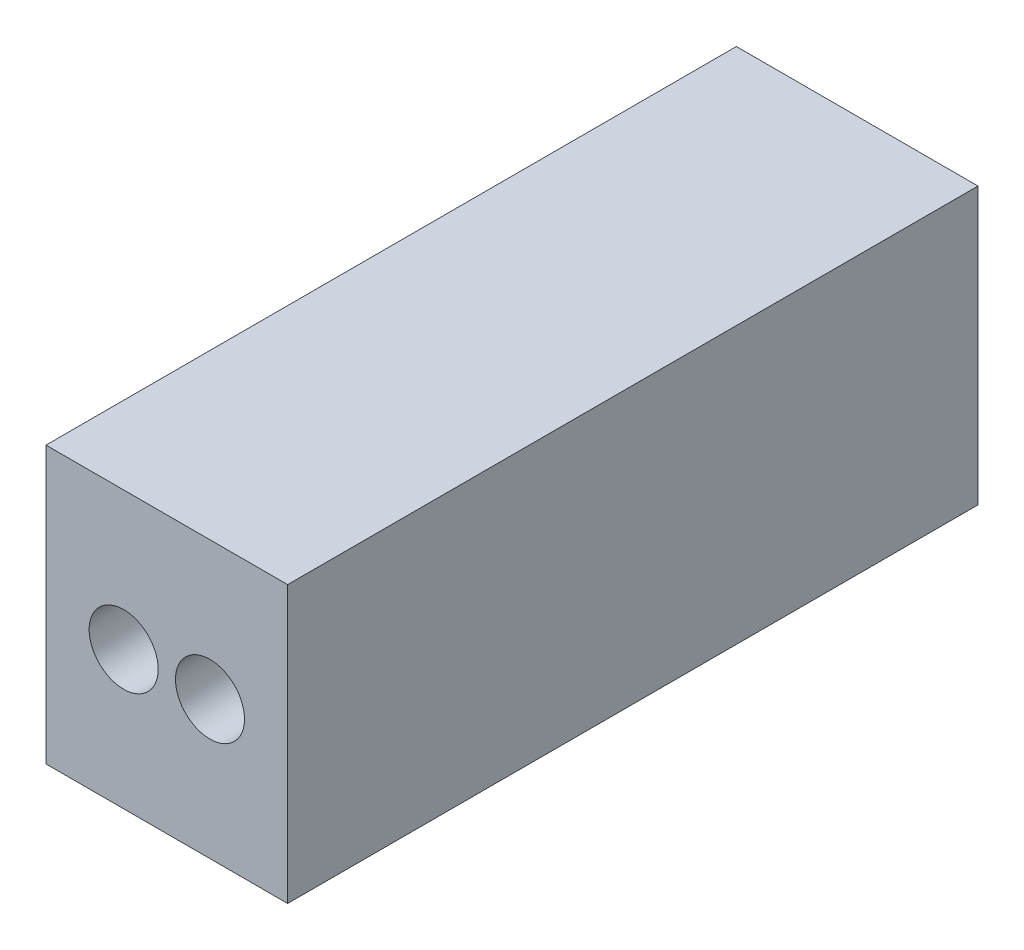
ISO-10303-21;
HEADER;
FILE_DESCRIPTION(('STEP AP214'),'2;1');
FILE_NAME('part.step','',(''),(''),'','','');
FILE_SCHEMA(('AUTOMOTIVE_DESIGN { 1 0 10303 214 1 1 1 1 }'));
ENDSEC;
DATA;
#1=APPLICATION_CONTEXT('core data for automotive mechanical design processes');
#2=APPLICATION_PROTOCOL_DEFINITION('international standard','automotive_design',2000,#1);
#3=PRODUCT_CONTEXT('',#1,'mechanical');
#4=PRODUCT('Part','Part','',(#3));
#5=PRODUCT_RELATED_PRODUCT_CATEGORY('part','',(#4));
#6=PRODUCT_DEFINITION_FORMATION('','',#4);
#7=PRODUCT_DEFINITION_CONTEXT('part definition',#1,'design');
#8=PRODUCT_DEFINITION('design','',#6,#7);
#9=PRODUCT_DEFINITION_SHAPE('','',#8);
#10=(LENGTH_UNIT() NAMED_UNIT(*) SI_UNIT(.MILLI.,.METRE.));
#11=(NAMED_UNIT(*) PLANE_ANGLE_UNIT() SI_UNIT($,.RADIAN.));
#12=(NAMED_UNIT(*) SI_UNIT($,.STERADIAN.) SOLID_ANGLE_UNIT());
#13=UNCERTAINTY_MEASURE_WITH_UNIT(LENGTH_MEASURE(1.E-05),#10,'distance_accuracy_value','');
#14=(GEOMETRIC_REPRESENTATION_CONTEXT(3) GLOBAL_UNCERTAINTY_ASSIGNED_CONTEXT((#13)) GLOBAL_UNIT_ASSIGNED_CONTEXT((#10,
#11,#12)) REPRESENTATION_CONTEXT('',''));
#15=CARTESIAN_POINT('',(0.,0.,0.));
#16=DIRECTION('',(0.,0.,1.));
#17=DIRECTION('',(1.,0.,0.));
#18=AXIS2_PLACEMENT_3D('',#15,#16,#17);
#19=CARTESIAN_POINT('',(0.,0.,10.));
#20=DIRECTION('',(1.,0.,0.));
#21=DIRECTION('',(0.,0.,-1.));
#22=AXIS2_PLACEMENT_3D('',#19,#20,#21);
#23=PLANE('',#22);
#24=DIRECTION('',(0.,-1.,0.));
#25=VECTOR('',#24,1.);
#26=CARTESIAN_POINT('',(0.,0.,0.));
#27=LINE('',#26,#25);
#28=CARTESIAN_POINT('',(0.,4.,0.));
#29=VERTEX_POINT('',#28);
#30=CARTESIAN_POINT('',(0.,0.,0.));
#31=VERTEX_POINT('',#30);
#32=EDGE_CURVE('E107',#29,#31,#27,.T.);
#33=ORIENTED_EDGE('',*,*,#32,.T.);
#34=DIRECTION('',(0.,0.,-1.));
#35=VECTOR('',#34,1.);
#36=CARTESIAN_POINT('',(0.,0.,10.));
#37=LINE('',#36,#35);
#38=CARTESIAN_POINT('',(0.,0.,10.));
#39=VERTEX_POINT('',#38);
#40=EDGE_CURVE('E11',#39,#31,#37,.T.);
#41=ORIENTED_EDGE('',*,*,#40,.F.);
#42=DIRECTION('',(0.,-1.,0.));
#43=VECTOR('',#42,1.);
#44=CARTESIAN_POINT('',(0.,0.,10.));
#45=LINE('',#44,#43);
#46=CARTESIAN_POINT('',(0.,4.,10.));
#47=VERTEX_POINT('',#46);
#48=EDGE_CURVE('E91',#47,#39,#45,.T.);
#49=ORIENTED_EDGE('',*,*,#48,.F.);
#50=DIRECTION('',(0.,0.,-1.));
#51=VECTOR('',#50,1.);
#52=CARTESIAN_POINT('',(0.,4.,10.));
#53=LINE('',#52,#51);
#54=EDGE_CURVE('E103',#47,#29,#53,.T.);
#55=ORIENTED_EDGE('',*,*,#54,.T.);
#56=EDGE_LOOP('',(#33,#41,#49,#55));
#57=FACE_BOUND('',#56,.T.);
#58=ADVANCED_FACE('F39',(#57),#23,.F.);
#59=CARTESIAN_POINT('',(0.,0.,10.));
#60=DIRECTION('',(0.,1.,0.));
#61=DIRECTION('',(0.,0.,1.));
#62=AXIS2_PLACEMENT_3D('',#59,#60,#61);
#63=PLANE('',#62);
#64=DIRECTION('',(1.,0.,0.));
#65=VECTOR('',#64,1.);
#66=CARTESIAN_POINT('',(0.,0.,0.));
#67=LINE('',#66,#65);
#68=CARTESIAN_POINT('',(3.5,0.,0.));
#69=VERTEX_POINT('',#68);
#70=EDGE_CURVE('E96',#31,#69,#67,.T.);
#71=ORIENTED_EDGE('',*,*,#70,.T.);
#72=DIRECTION('',(0.,0.,-1.));
#73=VECTOR('',#72,1.);
#74=CARTESIAN_POINT('',(3.5,0.,10.));
#75=LINE('',#74,#73);
#76=CARTESIAN_POINT('',(3.5,0.,10.));
#77=VERTEX_POINT('',#76);
#78=EDGE_CURVE('E48',#77,#69,#75,.T.);
#79=ORIENTED_EDGE('',*,*,#78,.F.);
#80=DIRECTION('',(1.,0.,0.));
#81=VECTOR('',#80,1.);
#82=CARTESIAN_POINT('',(0.,0.,10.));
#83=LINE('',#82,#81);
#84=EDGE_CURVE('E86',#39,#77,#83,.T.);
#85=ORIENTED_EDGE('',*,*,#84,.F.);
#86=ORIENTED_EDGE('',*,*,#40,.T.);
#87=EDGE_LOOP('',(#71,#79,#85,#86));
#88=FACE_BOUND('',#87,.T.);
#89=ADVANCED_FACE('F95',(#88),#63,.F.);
#90=CARTESIAN_POINT('',(3.5,0.,10.));
#91=DIRECTION('',(-1.,0.,0.));
#92=DIRECTION('',(0.,0.,1.));
#93=AXIS2_PLACEMENT_3D('',#90,#91,#92);
#94=PLANE('',#93);
#95=DIRECTION('',(0.,1.,0.));
#96=VECTOR('',#95,1.);
#97=CARTESIAN_POINT('',(3.5,0.,0.));
#98=LINE('',#97,#96);
#99=CARTESIAN_POINT('',(3.5,4.,0.));
#100=VERTEX_POINT('',#99);
#101=EDGE_CURVE('E73',#69,#100,#98,.T.);
#102=ORIENTED_EDGE('',*,*,#101,.T.);
#103=DIRECTION('',(0.,0.,-1.));
#104=VECTOR('',#103,1.);
#105=CARTESIAN_POINT('',(3.5,4.,10.));
#106=LINE('',#105,#104);
#107=CARTESIAN_POINT('',(3.5,4.,10.));
#108=VERTEX_POINT('',#107);
#109=EDGE_CURVE('E98',#108,#100,#106,.T.);
#110=ORIENTED_EDGE('',*,*,#109,.F.);
#111=DIRECTION('',(0.,1.,0.));
#112=VECTOR('',#111,1.);
#113=CARTESIAN_POINT('',(3.5,0.,10.));
#114=LINE('',#113,#112);
#115=EDGE_CURVE('E89',#77,#108,#114,.T.);
#116=ORIENTED_EDGE('',*,*,#115,.F.);
#117=ORIENTED_EDGE('',*,*,#78,.T.);
#118=EDGE_LOOP('',(#102,#110,#116,#117));
#119=FACE_BOUND('',#118,.T.);
#120=ADVANCED_FACE('F99',(#119),#94,.F.);
#121=CARTESIAN_POINT('',(0.,4.,10.));
#122=DIRECTION('',(0.,-1.,0.));
#123=DIRECTION('',(0.,0.,-1.));
#124=AXIS2_PLACEMENT_3D('',#121,#122,#123);
#125=PLANE('',#124);
#126=DIRECTION('',(-1.,0.,0.));
#127=VECTOR('',#126,1.);
#128=CARTESIAN_POINT('',(0.,4.,0.));
#129=LINE('',#128,#127);
#130=EDGE_CURVE('E79',#100,#29,#129,.T.);
#131=ORIENTED_EDGE('',*,*,#130,.T.);
#132=ORIENTED_EDGE('',*,*,#54,.F.);
#133=DIRECTION('',(-1.,0.,0.));
#134=VECTOR('',#133,1.);
#135=CARTESIAN_POINT('',(0.,4.,10.));
#136=LINE('',#135,#134);
#137=EDGE_CURVE('E56',#108,#47,#136,.T.);
#138=ORIENTED_EDGE('',*,*,#137,.F.);
#139=ORIENTED_EDGE('',*,*,#109,.T.);
#140=EDGE_LOOP('',(#131,#132,#138,#139));
#141=FACE_BOUND('',#140,.T.);
#142=ADVANCED_FACE('F121',(#141),#125,.F.);
#143=CARTESIAN_POINT('',(0.,0.,10.));
#144=DIRECTION('',(0.,0.,-1.));
#145=DIRECTION('',(-1.,0.,0.));
#146=AXIS2_PLACEMENT_3D('',#143,#144,#145);
#147=PLANE('',#146);
#148=CARTESIAN_POINT('',(1.125,2.,10.));
#149=DIRECTION('',(0.,0.,1.));
#150=DIRECTION('',(1.,0.,0.));
#151=AXIS2_PLACEMENT_3D('',#148,#149,#150);
#152=CIRCLE('',#151,0.5);
#153=CARTESIAN_POINT('',(1.625,2.,10.));
#154=VERTEX_POINT('',#153);
#155=EDGE_CURVE('E136',#154,#154,#152,.T.);
#156=ORIENTED_EDGE('',*,*,#155,.F.);
#157=EDGE_LOOP('',(#156));
#158=FACE_BOUND('',#157,.T.);
#159=CARTESIAN_POINT('',(2.375,2.,10.));
#160=DIRECTION('',(0.,0.,1.));
#161=DIRECTION('',(1.,0.,0.));
#162=AXIS2_PLACEMENT_3D('',#159,#160,#161);
#163=CIRCLE('',#162,0.5);
#164=CARTESIAN_POINT('',(2.875,2.,10.));
#165=VERTEX_POINT('',#164);
#166=EDGE_CURVE('E128',#165,#165,#163,.T.);
#167=ORIENTED_EDGE('',*,*,#166,.F.);
#168=EDGE_LOOP('',(#167));
#169=FACE_BOUND('',#168,.T.);
#170=ORIENTED_EDGE('',*,*,#48,.T.);
#171=ORIENTED_EDGE('',*,*,#84,.T.);
#172=ORIENTED_EDGE('',*,*,#115,.T.);
#173=ORIENTED_EDGE('',*,*,#137,.T.);
#174=EDGE_LOOP('',(#170,#171,#172,#173));
#175=FACE_BOUND('',#174,.T.);
#176=ADVANCED_FACE('F87',(#158,#169,#175),#147,.F.);
#177=CARTESIAN_POINT('',(0.,0.,0.));
#178=DIRECTION('',(0.,0.,-1.));
#179=DIRECTION('',(-1.,0.,0.));
#180=AXIS2_PLACEMENT_3D('',#177,#178,#179);
#181=PLANE('',#180);
#182=ORIENTED_EDGE('',*,*,#32,.F.);
#183=ORIENTED_EDGE('',*,*,#130,.F.);
#184=ORIENTED_EDGE('',*,*,#101,.F.);
#185=ORIENTED_EDGE('',*,*,#70,.F.);
#186=EDGE_LOOP('',(#182,#183,#184,#185));
#187=FACE_BOUND('',#186,.T.);
#188=ADVANCED_FACE('F124',(#187),#181,.T.);
#189=CARTESIAN_POINT('',(2.375,2.,5.));
#190=DIRECTION('',(0.,0.,1.));
#191=DIRECTION('',(1.,0.,0.));
#192=AXIS2_PLACEMENT_3D('',#189,#190,#191);
#193=CYLINDRICAL_SURFACE('',#192,0.5);
#194=CARTESIAN_POINT('',(2.375,2.,5.));
#195=DIRECTION('',(0.,0.,1.));
#196=DIRECTION('',(1.,0.,0.));
#197=AXIS2_PLACEMENT_3D('',#194,#195,#196);
#198=CIRCLE('',#197,0.5);
#199=CARTESIAN_POINT('',(2.875,2.,5.));
#200=VERTEX_POINT('',#199);
#201=EDGE_CURVE('E132',#200,#200,#198,.T.);
#202=ORIENTED_EDGE('',*,*,#201,.F.);
#203=EDGE_LOOP('',(#202));
#204=FACE_BOUND('',#203,.T.);
#205=ORIENTED_EDGE('',*,*,#166,.T.);
#206=EDGE_LOOP('',(#205));
#207=FACE_BOUND('',#206,.T.);
#208=ADVANCED_FACE('F158',(#204,#207),#193,.F.);
#209=CARTESIAN_POINT('',(2.375,2.,5.));
#210=DIRECTION('',(0.,0.,1.));
#211=DIRECTION('',(1.,0.,0.));
#212=AXIS2_PLACEMENT_3D('',#209,#210,#211);
#213=PLANE('',#212);
#214=ORIENTED_EDGE('',*,*,#201,.T.);
#215=EDGE_LOOP('',(#214));
#216=FACE_BOUND('',#215,.T.);
#217=ADVANCED_FACE('F149',(#216),#213,.T.);
#218=CARTESIAN_POINT('',(1.125,2.,5.));
#219=DIRECTION('',(0.,0.,1.));
#220=DIRECTION('',(1.,0.,0.));
#221=AXIS2_PLACEMENT_3D('',#218,#219,#220);
#222=CYLINDRICAL_SURFACE('',#221,0.5);
#223=CARTESIAN_POINT('',(1.125,2.,5.));
#224=DIRECTION('',(0.,0.,1.));
#225=DIRECTION('',(1.,0.,0.));
#226=AXIS2_PLACEMENT_3D('',#223,#224,#225);
#227=CIRCLE('',#226,0.5);
#228=CARTESIAN_POINT('',(1.625,2.,5.));
#229=VERTEX_POINT('',#228);
#230=EDGE_CURVE('E111',#229,#229,#227,.T.);
#231=ORIENTED_EDGE('',*,*,#230,.F.);
#232=EDGE_LOOP('',(#231));
#233=FACE_BOUND('',#232,.T.);
#234=ORIENTED_EDGE('',*,*,#155,.T.);
#235=EDGE_LOOP('',(#234));
#236=FACE_BOUND('',#235,.T.);
#237=ADVANCED_FACE('F146',(#233,#236),#222,.F.);
#238=CARTESIAN_POINT('',(1.125,2.,5.));
#239=DIRECTION('',(0.,0.,1.));
#240=DIRECTION('',(1.,0.,0.));
#241=AXIS2_PLACEMENT_3D('',#238,#239,#240);
#242=PLANE('',#241);
#243=ORIENTED_EDGE('',*,*,#230,.T.);
#244=EDGE_LOOP('',(#243));
#245=FACE_BOUND('',#244,.T.);
#246=ADVANCED_FACE('F144',(#245),#242,.T.);
#247=CLOSED_SHELL('',(#58,#89,#120,#142,#176,#188,#208,#217,#237,#246));
#248=MANIFOLD_SOLID_BREP('B2',#247);
#249=ADVANCED_BREP_SHAPE_REPRESENTATION('',(#18,#248),#14);
#250=SHAPE_DEFINITION_REPRESENTATION(#9,#249);
ENDSEC;
END-ISO-10303-21;
